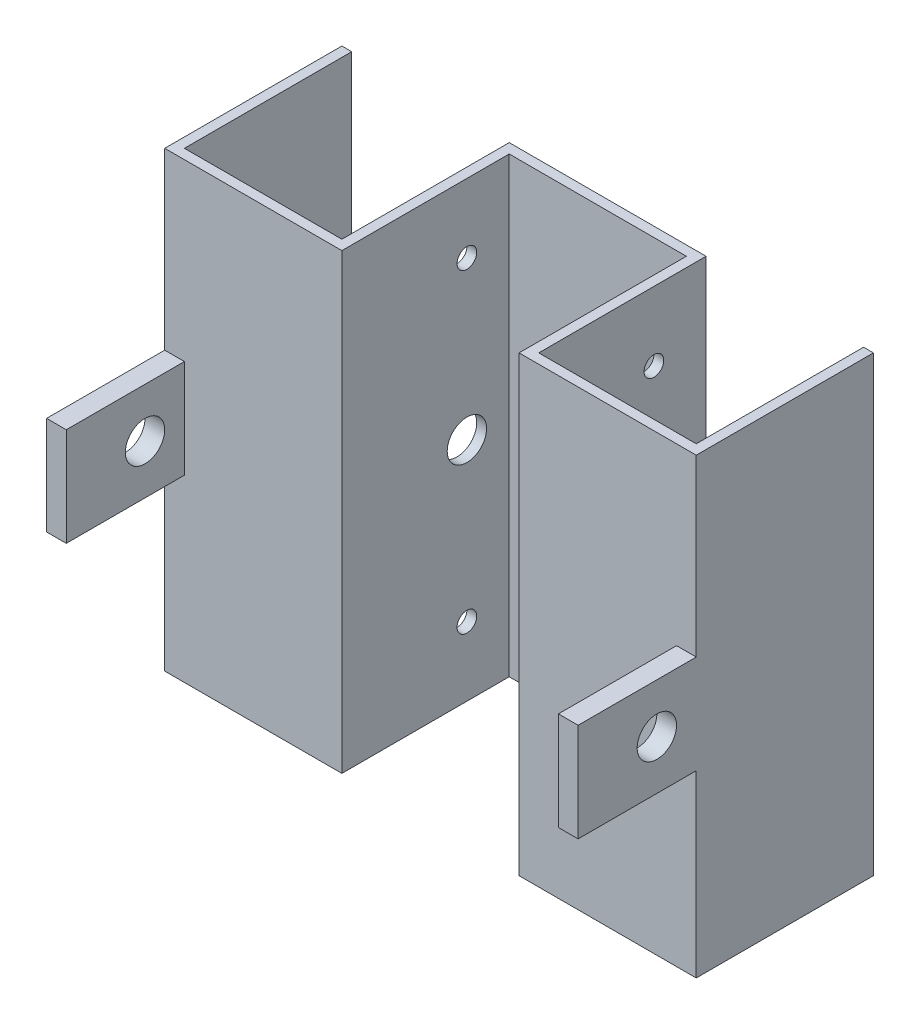
ISO-10303-21;
HEADER;
FILE_DESCRIPTION(('STEP AP214'),'2;1');
FILE_NAME('part.step','',(''),(''),'','','');
FILE_SCHEMA(('AUTOMOTIVE_DESIGN { 1 0 10303 214 1 1 1 1 }'));
ENDSEC;
DATA;
#1=APPLICATION_CONTEXT('core data for automotive mechanical design processes');
#2=APPLICATION_PROTOCOL_DEFINITION('international standard','automotive_design',2000,#1);
#3=PRODUCT_CONTEXT('',#1,'mechanical');
#4=PRODUCT('Part','Part','',(#3));
#5=PRODUCT_RELATED_PRODUCT_CATEGORY('part','',(#4));
#6=PRODUCT_DEFINITION_FORMATION('','',#4);
#7=PRODUCT_DEFINITION_CONTEXT('part definition',#1,'design');
#8=PRODUCT_DEFINITION('design','',#6,#7);
#9=PRODUCT_DEFINITION_SHAPE('','',#8);
#10=(LENGTH_UNIT() NAMED_UNIT(*) SI_UNIT(.MILLI.,.METRE.));
#11=(NAMED_UNIT(*) PLANE_ANGLE_UNIT() SI_UNIT($,.RADIAN.));
#12=(NAMED_UNIT(*) SI_UNIT($,.STERADIAN.) SOLID_ANGLE_UNIT());
#13=UNCERTAINTY_MEASURE_WITH_UNIT(LENGTH_MEASURE(1.E-05),#10,'distance_accuracy_value','');
#14=(GEOMETRIC_REPRESENTATION_CONTEXT(3) GLOBAL_UNCERTAINTY_ASSIGNED_CONTEXT((#13)) GLOBAL_UNIT_ASSIGNED_CONTEXT((#10,
#11,#12)) REPRESENTATION_CONTEXT('',''));
#15=CARTESIAN_POINT('',(0.,0.,0.));
#16=DIRECTION('',(0.,0.,1.));
#17=DIRECTION('',(1.,0.,0.));
#18=AXIS2_PLACEMENT_3D('',#15,#16,#17);
#19=CARTESIAN_POINT('',(0.,0.,90.));
#20=DIRECTION('',(0.,0.,-1.));
#21=DIRECTION('',(1.,0.,0.));
#22=AXIS2_PLACEMENT_3D('',#19,#20,#21);
#23=PLANE('',#22);
#24=DIRECTION('',(0.,1.,0.));
#25=VECTOR('',#24,1.);
#26=CARTESIAN_POINT('',(135.,250.,90.));
#27=LINE('',#26,#25);
#28=CARTESIAN_POINT('',(135.,151.191980235384,90.));
#29=VERTEX_POINT('',#28);
#30=CARTESIAN_POINT('',(135.,240.,90.));
#31=VERTEX_POINT('',#30);
#32=EDGE_CURVE('E435',#29,#31,#27,.T.);
#33=ORIENTED_EDGE('',*,*,#32,.T.);
#34=DIRECTION('',(1.,0.,0.));
#35=VECTOR('',#34,1.);
#36=CARTESIAN_POINT('',(-135.,240.,90.));
#37=LINE('',#36,#35);
#38=CARTESIAN_POINT('',(45.,240.,90.));
#39=VERTEX_POINT('',#38);
#40=EDGE_CURVE('E52',#39,#31,#37,.T.);
#41=ORIENTED_EDGE('',*,*,#40,.F.);
#42=DIRECTION('',(0.,1.,0.));
#43=VECTOR('',#42,1.);
#44=CARTESIAN_POINT('',(45.,250.,90.));
#45=LINE('',#44,#43);
#46=CARTESIAN_POINT('',(45.,9.99999999999999,90.));
#47=VERTEX_POINT('',#46);
#48=EDGE_CURVE('E247',#47,#39,#45,.T.);
#49=ORIENTED_EDGE('',*,*,#48,.F.);
#50=DIRECTION('',(1.,0.,0.));
#51=VECTOR('',#50,1.);
#52=CARTESIAN_POINT('',(-135.,10.,90.));
#53=LINE('',#52,#51);
#54=CARTESIAN_POINT('',(135.,9.99999999999998,90.));
#55=VERTEX_POINT('',#54);
#56=EDGE_CURVE('E323',#47,#55,#53,.T.);
#57=ORIENTED_EDGE('',*,*,#56,.T.);
#58=CARTESIAN_POINT('',(135.,101.191980235384,90.));
#59=VERTEX_POINT('',#58);
#60=EDGE_CURVE('E433',#55,#59,#27,.T.);
#61=ORIENTED_EDGE('',*,*,#60,.T.);
#62=DIRECTION('',(1.,0.,0.));
#63=VECTOR('',#62,1.);
#64=CARTESIAN_POINT('',(125.,101.191980235384,90.));
#65=LINE('',#64,#63);
#66=CARTESIAN_POINT('',(125.,101.191980235384,90.));
#67=VERTEX_POINT('',#66);
#68=EDGE_CURVE('E404',#67,#59,#65,.T.);
#69=ORIENTED_EDGE('',*,*,#68,.F.);
#70=DIRECTION('',(0.,-1.,0.));
#71=VECTOR('',#70,1.);
#72=CARTESIAN_POINT('',(125.,0.,90.));
#73=LINE('',#72,#71);
#74=CARTESIAN_POINT('',(125.,151.191980235384,90.));
#75=VERTEX_POINT('',#74);
#76=EDGE_CURVE('E380',#75,#67,#73,.T.);
#77=ORIENTED_EDGE('',*,*,#76,.F.);
#78=DIRECTION('',(1.,0.,0.));
#79=VECTOR('',#78,1.);
#80=CARTESIAN_POINT('',(125.,151.191980235384,90.));
#81=LINE('',#80,#79);
#82=EDGE_CURVE('E394',#75,#29,#81,.T.);
#83=ORIENTED_EDGE('',*,*,#82,.T.);
#84=EDGE_LOOP('',(#33,#41,#49,#57,#61,#69,#77,#83));
#85=FACE_BOUND('',#84,.T.);
#86=ADVANCED_FACE('F35',(#85),#23,.F.);
#87=CARTESIAN_POINT('',(50.,0.,5.));
#88=DIRECTION('',(1.,0.,0.));
#89=DIRECTION('',(0.,0.,-1.));
#90=AXIS2_PLACEMENT_3D('',#87,#88,#89);
#91=PLANE('',#90);
#92=DIRECTION('',(0.,0.,-1.));
#93=VECTOR('',#92,1.);
#94=CARTESIAN_POINT('',(50.,240.,5.));
#95=LINE('',#94,#93);
#96=CARTESIAN_POINT('',(50.,240.,85.));
#97=VERTEX_POINT('',#96);
#98=CARTESIAN_POINT('',(50.,240.,0.));
#99=VERTEX_POINT('',#98);
#100=EDGE_CURVE('E459',#97,#99,#95,.T.);
#101=ORIENTED_EDGE('',*,*,#100,.F.);
#102=DIRECTION('',(0.,-1.,0.));
#103=VECTOR('',#102,1.);
#104=CARTESIAN_POINT('',(50.,250.,85.));
#105=LINE('',#104,#103);
#106=CARTESIAN_POINT('',(50.,9.99999999999999,85.));
#107=VERTEX_POINT('',#106);
#108=EDGE_CURVE('E252',#97,#107,#105,.T.);
#109=ORIENTED_EDGE('',*,*,#108,.T.);
#110=DIRECTION('',(0.,0.,1.));
#111=VECTOR('',#110,1.);
#112=CARTESIAN_POINT('',(50.,10.,5.));
#113=LINE('',#112,#111);
#114=CARTESIAN_POINT('',(50.,10.,0.));
#115=VERTEX_POINT('',#114);
#116=EDGE_CURVE('E333',#115,#107,#113,.T.);
#117=ORIENTED_EDGE('',*,*,#116,.F.);
#118=DIRECTION('',(0.,-1.,0.));
#119=VECTOR('',#118,1.);
#120=CARTESIAN_POINT('',(50.,0.,0.));
#121=LINE('',#120,#119);
#122=EDGE_CURVE('E254',#99,#115,#121,.T.);
#123=ORIENTED_EDGE('',*,*,#122,.F.);
#124=EDGE_LOOP('',(#101,#109,#117,#123));
#125=FACE_BOUND('',#124,.T.);
#126=CARTESIAN_POINT('',(50.,205.,26.5));
#127=DIRECTION('',(-1.,0.,0.));
#128=DIRECTION('',(0.,0.,1.));
#129=AXIS2_PLACEMENT_3D('',#126,#127,#128);
#130=CIRCLE('',#129,5.);
#131=CARTESIAN_POINT('',(50.,205.,31.5));
#132=VERTEX_POINT('',#131);
#133=EDGE_CURVE('E418',#132,#132,#130,.T.);
#134=ORIENTED_EDGE('',*,*,#133,.T.);
#135=EDGE_LOOP('',(#134));
#136=FACE_BOUND('',#135,.T.);
#137=CARTESIAN_POINT('',(50.,125.,26.5));
#138=DIRECTION('',(-1.,0.,0.));
#139=DIRECTION('',(0.,0.,1.));
#140=AXIS2_PLACEMENT_3D('',#137,#138,#139);
#141=CIRCLE('',#140,10.);
#142=CARTESIAN_POINT('',(50.,125.,36.5));
#143=VERTEX_POINT('',#142);
#144=EDGE_CURVE('E424',#143,#143,#141,.T.);
#145=ORIENTED_EDGE('',*,*,#144,.T.);
#146=EDGE_LOOP('',(#145));
#147=FACE_BOUND('',#146,.T.);
#148=CARTESIAN_POINT('',(50.,45.,26.5));
#149=DIRECTION('',(-1.,0.,0.));
#150=DIRECTION('',(0.,0.,1.));
#151=AXIS2_PLACEMENT_3D('',#148,#149,#150);
#152=CIRCLE('',#151,5.);
#153=CARTESIAN_POINT('',(50.,45.,31.5));
#154=VERTEX_POINT('',#153);
#155=EDGE_CURVE('E407',#154,#154,#152,.T.);
#156=ORIENTED_EDGE('',*,*,#155,.T.);
#157=EDGE_LOOP('',(#156));
#158=FACE_BOUND('',#157,.T.);
#159=ADVANCED_FACE('F506',(#125,#136,#147,#158),#91,.T.);
#160=CARTESIAN_POINT('',(45.,250.,85.));
#161=DIRECTION('',(-1.,0.,0.));
#162=DIRECTION('',(0.,-1.,0.));
#163=AXIS2_PLACEMENT_3D('',#160,#161,#162);
#164=PLANE('',#163);
#165=DIRECTION('',(0.,0.,1.));
#166=VECTOR('',#165,1.);
#167=CARTESIAN_POINT('',(45.,240.,85.));
#168=LINE('',#167,#166);
#169=CARTESIAN_POINT('',(45.,240.,5.));
#170=VERTEX_POINT('',#169);
#171=EDGE_CURVE('E308',#170,#39,#168,.T.);
#172=ORIENTED_EDGE('',*,*,#171,.F.);
#173=DIRECTION('',(0.,1.,0.));
#174=VECTOR('',#173,1.);
#175=CARTESIAN_POINT('',(45.,250.,5.));
#176=LINE('',#175,#174);
#177=CARTESIAN_POINT('',(45.,10.,5.));
#178=VERTEX_POINT('',#177);
#179=EDGE_CURVE('E255',#178,#170,#176,.T.);
#180=ORIENTED_EDGE('',*,*,#179,.F.);
#181=DIRECTION('',(0.,0.,-1.));
#182=VECTOR('',#181,1.);
#183=CARTESIAN_POINT('',(45.,9.99999999999998,85.));
#184=LINE('',#183,#182);
#185=EDGE_CURVE('E344',#47,#178,#184,.T.);
#186=ORIENTED_EDGE('',*,*,#185,.F.);
#187=ORIENTED_EDGE('',*,*,#48,.T.);
#188=EDGE_LOOP('',(#172,#180,#186,#187));
#189=FACE_BOUND('',#188,.T.);
#190=CARTESIAN_POINT('',(45.,205.,26.5));
#191=DIRECTION('',(-1.,0.,0.));
#192=DIRECTION('',(0.,0.,1.));
#193=AXIS2_PLACEMENT_3D('',#190,#191,#192);
#194=CIRCLE('',#193,5.);
#195=CARTESIAN_POINT('',(45.,205.,31.5));
#196=VERTEX_POINT('',#195);
#197=EDGE_CURVE('E421',#196,#196,#194,.T.);
#198=ORIENTED_EDGE('',*,*,#197,.F.);
#199=EDGE_LOOP('',(#198));
#200=FACE_BOUND('',#199,.T.);
#201=CARTESIAN_POINT('',(45.,125.,26.5));
#202=DIRECTION('',(-1.,0.,0.));
#203=DIRECTION('',(0.,0.,1.));
#204=AXIS2_PLACEMENT_3D('',#201,#202,#203);
#205=CIRCLE('',#204,10.);
#206=CARTESIAN_POINT('',(45.,125.,36.5));
#207=VERTEX_POINT('',#206);
#208=EDGE_CURVE('E427',#207,#207,#205,.T.);
#209=ORIENTED_EDGE('',*,*,#208,.F.);
#210=EDGE_LOOP('',(#209));
#211=FACE_BOUND('',#210,.T.);
#212=CARTESIAN_POINT('',(45.,45.,26.5));
#213=DIRECTION('',(-1.,0.,0.));
#214=DIRECTION('',(0.,0.,1.));
#215=AXIS2_PLACEMENT_3D('',#212,#213,#214);
#216=CIRCLE('',#215,5.);
#217=CARTESIAN_POINT('',(45.,45.,31.5));
#218=VERTEX_POINT('',#217);
#219=EDGE_CURVE('E415',#218,#218,#216,.T.);
#220=ORIENTED_EDGE('',*,*,#219,.F.);
#221=EDGE_LOOP('',(#220));
#222=FACE_BOUND('',#221,.T.);
#223=ADVANCED_FACE('F281',(#189,#200,#211,#222),#164,.T.);
#224=CARTESIAN_POINT('',(-50.,0.,5.));
#225=DIRECTION('',(1.,0.,0.));
#226=DIRECTION('',(0.,0.,-1.));
#227=AXIS2_PLACEMENT_3D('',#224,#225,#226);
#228=PLANE('',#227);
#229=CARTESIAN_POINT('',(-50.,45.,26.5));
#230=DIRECTION('',(-1.,0.,0.));
#231=DIRECTION('',(0.,0.,1.));
#232=AXIS2_PLACEMENT_3D('',#229,#230,#231);
#233=CIRCLE('',#232,5.);
#234=CARTESIAN_POINT('',(-50.,45.,31.5));
#235=VERTEX_POINT('',#234);
#236=EDGE_CURVE('E260',#235,#235,#233,.T.);
#237=ORIENTED_EDGE('',*,*,#236,.F.);
#238=EDGE_LOOP('',(#237));
#239=FACE_BOUND('',#238,.T.);
#240=CARTESIAN_POINT('',(-50.,205.,26.5));
#241=DIRECTION('',(-1.,0.,0.));
#242=DIRECTION('',(0.,0.,1.));
#243=AXIS2_PLACEMENT_3D('',#240,#241,#242);
#244=CIRCLE('',#243,5.);
#245=CARTESIAN_POINT('',(-50.,205.,31.5));
#246=VERTEX_POINT('',#245);
#247=EDGE_CURVE('E263',#246,#246,#244,.T.);
#248=ORIENTED_EDGE('',*,*,#247,.F.);
#249=EDGE_LOOP('',(#248));
#250=FACE_BOUND('',#249,.T.);
#251=CARTESIAN_POINT('',(-50.,125.,26.5));
#252=DIRECTION('',(-1.,0.,0.));
#253=DIRECTION('',(0.,0.,1.));
#254=AXIS2_PLACEMENT_3D('',#251,#252,#253);
#255=CIRCLE('',#254,10.);
#256=CARTESIAN_POINT('',(-50.,125.,36.5));
#257=VERTEX_POINT('',#256);
#258=EDGE_CURVE('E234',#257,#257,#255,.T.);
#259=ORIENTED_EDGE('',*,*,#258,.F.);
#260=EDGE_LOOP('',(#259));
#261=FACE_BOUND('',#260,.T.);
#262=DIRECTION('',(0.,-1.,0.));
#263=VECTOR('',#262,1.);
#264=CARTESIAN_POINT('',(-50.,250.,85.));
#265=LINE('',#264,#263);
#266=CARTESIAN_POINT('',(-50.,240.,85.));
#267=VERTEX_POINT('',#266);
#268=CARTESIAN_POINT('',(-50.,10.,85.));
#269=VERTEX_POINT('',#268);
#270=EDGE_CURVE('E39',#267,#269,#265,.T.);
#271=ORIENTED_EDGE('',*,*,#270,.F.);
#272=DIRECTION('',(0.,0.,-1.));
#273=VECTOR('',#272,1.);
#274=CARTESIAN_POINT('',(-50.,240.,5.));
#275=LINE('',#274,#273);
#276=CARTESIAN_POINT('',(-50.,240.,0.));
#277=VERTEX_POINT('',#276);
#278=EDGE_CURVE('E286',#267,#277,#275,.T.);
#279=ORIENTED_EDGE('',*,*,#278,.T.);
#280=DIRECTION('',(0.,-1.,0.));
#281=VECTOR('',#280,1.);
#282=CARTESIAN_POINT('',(-50.,0.,0.));
#283=LINE('',#282,#281);
#284=CARTESIAN_POINT('',(-50.,10.,0.));
#285=VERTEX_POINT('',#284);
#286=EDGE_CURVE('E11',#277,#285,#283,.T.);
#287=ORIENTED_EDGE('',*,*,#286,.T.);
#288=DIRECTION('',(0.,0.,1.));
#289=VECTOR('',#288,1.);
#290=CARTESIAN_POINT('',(-50.,10.,5.));
#291=LINE('',#290,#289);
#292=EDGE_CURVE('E289',#285,#269,#291,.T.);
#293=ORIENTED_EDGE('',*,*,#292,.T.);
#294=EDGE_LOOP('',(#271,#279,#287,#293));
#295=FACE_BOUND('',#294,.T.);
#296=ADVANCED_FACE('F37',(#239,#250,#261,#295),#228,.F.);
#297=CARTESIAN_POINT('',(0.,0.,5.));
#298=DIRECTION('',(0.,0.,1.));
#299=DIRECTION('',(1.,0.,0.));
#300=AXIS2_PLACEMENT_3D('',#297,#298,#299);
#301=PLANE('',#300);
#302=DIRECTION('',(1.,0.,0.));
#303=VECTOR('',#302,1.);
#304=CARTESIAN_POINT('',(0.,240.,5.));
#305=LINE('',#304,#303);
#306=CARTESIAN_POINT('',(-45.,240.,5.));
#307=VERTEX_POINT('',#306);
#308=EDGE_CURVE('E306',#307,#170,#305,.T.);
#309=ORIENTED_EDGE('',*,*,#308,.F.);
#310=DIRECTION('',(0.,1.,0.));
#311=VECTOR('',#310,1.);
#312=CARTESIAN_POINT('',(-45.,250.,5.));
#313=LINE('',#312,#311);
#314=CARTESIAN_POINT('',(-45.,10.,5.));
#315=VERTEX_POINT('',#314);
#316=EDGE_CURVE('E239',#315,#307,#313,.T.);
#317=ORIENTED_EDGE('',*,*,#316,.F.);
#318=DIRECTION('',(-1.,0.,0.));
#319=VECTOR('',#318,1.);
#320=CARTESIAN_POINT('',(0.,10.,5.));
#321=LINE('',#320,#319);
#322=EDGE_CURVE('E304',#178,#315,#321,.T.);
#323=ORIENTED_EDGE('',*,*,#322,.F.);
#324=ORIENTED_EDGE('',*,*,#179,.T.);
#325=EDGE_LOOP('',(#309,#317,#323,#324));
#326=FACE_BOUND('',#325,.T.);
#327=ADVANCED_FACE('F280',(#326),#301,.T.);
#328=CARTESIAN_POINT('',(0.,0.,0.));
#329=DIRECTION('',(0.,0.,1.));
#330=DIRECTION('',(1.,0.,0.));
#331=AXIS2_PLACEMENT_3D('',#328,#329,#330);
#332=PLANE('',#331);
#333=ORIENTED_EDGE('',*,*,#286,.F.);
#334=DIRECTION('',(1.,0.,0.));
#335=VECTOR('',#334,1.);
#336=CARTESIAN_POINT('',(-135.,240.,0.));
#337=LINE('',#336,#335);
#338=EDGE_CURVE('E454',#277,#99,#337,.T.);
#339=ORIENTED_EDGE('',*,*,#338,.T.);
#340=ORIENTED_EDGE('',*,*,#122,.T.);
#341=DIRECTION('',(1.,0.,0.));
#342=VECTOR('',#341,1.);
#343=CARTESIAN_POINT('',(-135.,10.,0.));
#344=LINE('',#343,#342);
#345=EDGE_CURVE('E327',#285,#115,#344,.T.);
#346=ORIENTED_EDGE('',*,*,#345,.F.);
#347=EDGE_LOOP('',(#333,#339,#340,#346));
#348=FACE_BOUND('',#347,.T.);
#349=ADVANCED_FACE('F548',(#348),#332,.F.);
#350=CARTESIAN_POINT('',(-45.,250.,85.));
#351=DIRECTION('',(-1.,0.,0.));
#352=DIRECTION('',(0.,-1.,0.));
#353=AXIS2_PLACEMENT_3D('',#350,#351,#352);
#354=PLANE('',#353);
#355=CARTESIAN_POINT('',(-45.,45.,26.5));
#356=DIRECTION('',(-1.,0.,0.));
#357=DIRECTION('',(0.,0.,1.));
#358=AXIS2_PLACEMENT_3D('',#355,#356,#357);
#359=CIRCLE('',#358,5.);
#360=CARTESIAN_POINT('',(-45.,45.,31.5));
#361=VERTEX_POINT('',#360);
#362=EDGE_CURVE('E259',#361,#361,#359,.T.);
#363=ORIENTED_EDGE('',*,*,#362,.T.);
#364=EDGE_LOOP('',(#363));
#365=FACE_BOUND('',#364,.T.);
#366=CARTESIAN_POINT('',(-45.,205.,26.5));
#367=DIRECTION('',(-1.,0.,0.));
#368=DIRECTION('',(0.,0.,1.));
#369=AXIS2_PLACEMENT_3D('',#366,#367,#368);
#370=CIRCLE('',#369,5.);
#371=CARTESIAN_POINT('',(-45.,205.,31.5));
#372=VERTEX_POINT('',#371);
#373=EDGE_CURVE('E266',#372,#372,#370,.T.);
#374=ORIENTED_EDGE('',*,*,#373,.T.);
#375=EDGE_LOOP('',(#374));
#376=FACE_BOUND('',#375,.T.);
#377=CARTESIAN_POINT('',(-45.,125.,26.5));
#378=DIRECTION('',(-1.,0.,0.));
#379=DIRECTION('',(0.,0.,1.));
#380=AXIS2_PLACEMENT_3D('',#377,#378,#379);
#381=CIRCLE('',#380,10.);
#382=CARTESIAN_POINT('',(-45.,125.,36.5));
#383=VERTEX_POINT('',#382);
#384=EDGE_CURVE('E230',#383,#383,#381,.T.);
#385=ORIENTED_EDGE('',*,*,#384,.T.);
#386=EDGE_LOOP('',(#385));
#387=FACE_BOUND('',#386,.T.);
#388=ORIENTED_EDGE('',*,*,#316,.T.);
#389=DIRECTION('',(0.,0.,1.));
#390=VECTOR('',#389,1.);
#391=CARTESIAN_POINT('',(-45.,240.,85.));
#392=LINE('',#391,#390);
#393=CARTESIAN_POINT('',(-45.,240.,90.));
#394=VERTEX_POINT('',#393);
#395=EDGE_CURVE('E299',#307,#394,#392,.T.);
#396=ORIENTED_EDGE('',*,*,#395,.T.);
#397=DIRECTION('',(0.,1.,0.));
#398=VECTOR('',#397,1.);
#399=CARTESIAN_POINT('',(-45.,250.,90.));
#400=LINE('',#399,#398);
#401=CARTESIAN_POINT('',(-45.,10.,90.));
#402=VERTEX_POINT('',#401);
#403=EDGE_CURVE('E217',#402,#394,#400,.T.);
#404=ORIENTED_EDGE('',*,*,#403,.F.);
#405=DIRECTION('',(0.,0.,-1.));
#406=VECTOR('',#405,1.);
#407=CARTESIAN_POINT('',(-45.,10.,85.));
#408=LINE('',#407,#406);
#409=EDGE_CURVE('E300',#402,#315,#408,.T.);
#410=ORIENTED_EDGE('',*,*,#409,.T.);
#411=EDGE_LOOP('',(#388,#396,#404,#410));
#412=FACE_BOUND('',#411,.T.);
#413=ADVANCED_FACE('F298',(#365,#376,#387,#412),#354,.F.);
#414=CARTESIAN_POINT('',(0.,0.,90.));
#415=DIRECTION('',(0.,0.,-1.));
#416=DIRECTION('',(-1.,0.,0.));
#417=AXIS2_PLACEMENT_3D('',#414,#415,#416);
#418=PLANE('',#417);
#419=ORIENTED_EDGE('',*,*,#403,.T.);
#420=CARTESIAN_POINT('',(-135.,240.,90.));
#421=VERTEX_POINT('',#420);
#422=EDGE_CURVE('E200',#421,#394,#37,.T.);
#423=ORIENTED_EDGE('',*,*,#422,.F.);
#424=DIRECTION('',(0.,1.,0.));
#425=VECTOR('',#424,1.);
#426=CARTESIAN_POINT('',(-135.,250.,90.));
#427=LINE('',#426,#425);
#428=CARTESIAN_POINT('',(-135.,151.191980235384,90.));
#429=VERTEX_POINT('',#428);
#430=EDGE_CURVE('E214',#429,#421,#427,.T.);
#431=ORIENTED_EDGE('',*,*,#430,.F.);
#432=DIRECTION('',(-1.,0.,0.));
#433=VECTOR('',#432,1.);
#434=CARTESIAN_POINT('',(-125.,151.191980235384,90.));
#435=LINE('',#434,#433);
#436=CARTESIAN_POINT('',(-125.,151.191980235384,90.));
#437=VERTEX_POINT('',#436);
#438=EDGE_CURVE('E371',#437,#429,#435,.T.);
#439=ORIENTED_EDGE('',*,*,#438,.F.);
#440=DIRECTION('',(0.,-1.,0.));
#441=VECTOR('',#440,1.);
#442=CARTESIAN_POINT('',(-125.,151.191980235384,90.));
#443=LINE('',#442,#441);
#444=CARTESIAN_POINT('',(-125.,101.191980235384,90.));
#445=VERTEX_POINT('',#444);
#446=EDGE_CURVE('E353',#437,#445,#443,.T.);
#447=ORIENTED_EDGE('',*,*,#446,.T.);
#448=DIRECTION('',(-1.,0.,0.));
#449=VECTOR('',#448,1.);
#450=CARTESIAN_POINT('',(-125.,101.191980235384,90.));
#451=LINE('',#450,#449);
#452=CARTESIAN_POINT('',(-135.,101.191980235384,90.));
#453=VERTEX_POINT('',#452);
#454=EDGE_CURVE('E365',#445,#453,#451,.T.);
#455=ORIENTED_EDGE('',*,*,#454,.T.);
#456=CARTESIAN_POINT('',(-135.,10.,90.));
#457=VERTEX_POINT('',#456);
#458=EDGE_CURVE('E226',#457,#453,#427,.T.);
#459=ORIENTED_EDGE('',*,*,#458,.F.);
#460=EDGE_CURVE('E320',#457,#402,#53,.T.);
#461=ORIENTED_EDGE('',*,*,#460,.T.);
#462=EDGE_LOOP('',(#419,#423,#431,#439,#447,#455,#459,#461));
#463=FACE_BOUND('',#462,.T.);
#464=ADVANCED_FACE('F212',(#463),#418,.F.);
#465=CARTESIAN_POINT('',(0.,0.,85.));
#466=DIRECTION('',(0.,0.,-1.));
#467=DIRECTION('',(-1.,0.,0.));
#468=AXIS2_PLACEMENT_3D('',#465,#466,#467);
#469=PLANE('',#468);
#470=DIRECTION('',(-1.,0.,0.));
#471=VECTOR('',#470,1.);
#472=CARTESIAN_POINT('',(0.,240.,85.));
#473=LINE('',#472,#471);
#474=CARTESIAN_POINT('',(-130.,240.,85.));
#475=VERTEX_POINT('',#474);
#476=EDGE_CURVE('E463',#267,#475,#473,.T.);
#477=ORIENTED_EDGE('',*,*,#476,.F.);
#478=ORIENTED_EDGE('',*,*,#270,.T.);
#479=DIRECTION('',(1.,0.,0.));
#480=VECTOR('',#479,1.);
#481=CARTESIAN_POINT('',(0.,10.,85.));
#482=LINE('',#481,#480);
#483=CARTESIAN_POINT('',(-130.,10.,85.));
#484=VERTEX_POINT('',#483);
#485=EDGE_CURVE('E339',#484,#269,#482,.T.);
#486=ORIENTED_EDGE('',*,*,#485,.F.);
#487=DIRECTION('',(0.,-1.,0.));
#488=VECTOR('',#487,1.);
#489=CARTESIAN_POINT('',(-130.,250.,85.));
#490=LINE('',#489,#488);
#491=EDGE_CURVE('E236',#475,#484,#490,.T.);
#492=ORIENTED_EDGE('',*,*,#491,.F.);
#493=EDGE_LOOP('',(#477,#478,#486,#492));
#494=FACE_BOUND('',#493,.T.);
#495=ADVANCED_FACE('F470',(#494),#469,.T.);
#496=CARTESIAN_POINT('',(-135.,250.,0.));
#497=DIRECTION('',(0.,0.,1.));
#498=DIRECTION('',(1.,0.,0.));
#499=AXIS2_PLACEMENT_3D('',#496,#497,#498);
#500=PLANE('',#499);
#501=DIRECTION('',(0.,-1.,0.));
#502=VECTOR('',#501,1.);
#503=CARTESIAN_POINT('',(-135.,250.,0.));
#504=LINE('',#503,#502);
#505=CARTESIAN_POINT('',(-135.,240.,0.));
#506=VERTEX_POINT('',#505);
#507=CARTESIAN_POINT('',(-135.,10.,0.));
#508=VERTEX_POINT('',#507);
#509=EDGE_CURVE('E229',#506,#508,#504,.T.);
#510=ORIENTED_EDGE('',*,*,#509,.F.);
#511=CARTESIAN_POINT('',(-130.,240.,0.));
#512=VERTEX_POINT('',#511);
#513=EDGE_CURVE('E203',#506,#512,#337,.T.);
#514=ORIENTED_EDGE('',*,*,#513,.T.);
#515=DIRECTION('',(0.,-1.,0.));
#516=VECTOR('',#515,1.);
#517=CARTESIAN_POINT('',(-130.,250.,0.));
#518=LINE('',#517,#516);
#519=CARTESIAN_POINT('',(-130.,10.,0.));
#520=VERTEX_POINT('',#519);
#521=EDGE_CURVE('E227',#512,#520,#518,.T.);
#522=ORIENTED_EDGE('',*,*,#521,.T.);
#523=EDGE_CURVE('E324',#508,#520,#344,.T.);
#524=ORIENTED_EDGE('',*,*,#523,.F.);
#525=EDGE_LOOP('',(#510,#514,#522,#524));
#526=FACE_BOUND('',#525,.T.);
#527=ADVANCED_FACE('F478',(#526),#500,.F.);
#528=CARTESIAN_POINT('',(-135.,0.,0.));
#529=DIRECTION('',(1.,0.,0.));
#530=DIRECTION('',(0.,1.,0.));
#531=AXIS2_PLACEMENT_3D('',#528,#529,#530);
#532=PLANE('',#531);
#533=ORIENTED_EDGE('',*,*,#430,.T.);
#534=DIRECTION('',(0.,0.,-1.));
#535=VECTOR('',#534,1.);
#536=CARTESIAN_POINT('',(-135.,240.,90.));
#537=LINE('',#536,#535);
#538=EDGE_CURVE('E197',#421,#506,#537,.T.);
#539=ORIENTED_EDGE('',*,*,#538,.T.);
#540=ORIENTED_EDGE('',*,*,#509,.T.);
#541=DIRECTION('',(0.,0.,1.));
#542=VECTOR('',#541,1.);
#543=CARTESIAN_POINT('',(-135.,10.,90.));
#544=LINE('',#543,#542);
#545=EDGE_CURVE('E315',#508,#457,#544,.T.);
#546=ORIENTED_EDGE('',*,*,#545,.T.);
#547=ORIENTED_EDGE('',*,*,#458,.T.);
#548=DIRECTION('',(0.,0.,1.));
#549=VECTOR('',#548,1.);
#550=CARTESIAN_POINT('',(-135.,101.191980235384,90.));
#551=LINE('',#550,#549);
#552=CARTESIAN_POINT('',(-135.,101.191980235384,150.));
#553=VERTEX_POINT('',#552);
#554=EDGE_CURVE('E350',#453,#553,#551,.T.);
#555=ORIENTED_EDGE('',*,*,#554,.T.);
#556=DIRECTION('',(0.,1.,0.));
#557=VECTOR('',#556,1.);
#558=CARTESIAN_POINT('',(-135.,151.191980235384,150.));
#559=LINE('',#558,#557);
#560=CARTESIAN_POINT('',(-135.,151.191980235384,150.));
#561=VERTEX_POINT('',#560);
#562=EDGE_CURVE('E368',#553,#561,#559,.T.);
#563=ORIENTED_EDGE('',*,*,#562,.T.);
#564=DIRECTION('',(0.,0.,-1.));
#565=VECTOR('',#564,1.);
#566=CARTESIAN_POINT('',(-135.,151.191980235384,90.));
#567=LINE('',#566,#565);
#568=EDGE_CURVE('E224',#561,#429,#567,.T.);
#569=ORIENTED_EDGE('',*,*,#568,.T.);
#570=EDGE_LOOP('',(#533,#539,#540,#546,#547,#555,#563,#569));
#571=FACE_BOUND('',#570,.T.);
#572=CARTESIAN_POINT('',(-135.,126.191980235384,110.));
#573=DIRECTION('',(-1.,0.,0.));
#574=DIRECTION('',(0.,-1.,0.));
#575=AXIS2_PLACEMENT_3D('',#572,#573,#574);
#576=CIRCLE('',#575,10.);
#577=CARTESIAN_POINT('',(-135.,116.191980235384,110.));
#578=VERTEX_POINT('',#577);
#579=EDGE_CURVE('E346',#578,#578,#576,.T.);
#580=ORIENTED_EDGE('',*,*,#579,.F.);
#581=EDGE_LOOP('',(#580));
#582=FACE_BOUND('',#581,.T.);
#583=ADVANCED_FACE('F220',(#571,#582),#532,.F.);
#584=CARTESIAN_POINT('',(-130.,0.,0.));
#585=DIRECTION('',(1.,0.,0.));
#586=DIRECTION('',(0.,1.,0.));
#587=AXIS2_PLACEMENT_3D('',#584,#585,#586);
#588=PLANE('',#587);
#589=DIRECTION('',(0.,0.,-1.));
#590=VECTOR('',#589,1.);
#591=CARTESIAN_POINT('',(-130.,240.,0.));
#592=LINE('',#591,#590);
#593=EDGE_CURVE('E461',#475,#512,#592,.T.);
#594=ORIENTED_EDGE('',*,*,#593,.F.);
#595=ORIENTED_EDGE('',*,*,#491,.T.);
#596=DIRECTION('',(0.,0.,1.));
#597=VECTOR('',#596,1.);
#598=CARTESIAN_POINT('',(-130.,10.,0.));
#599=LINE('',#598,#597);
#600=EDGE_CURVE('E336',#520,#484,#599,.T.);
#601=ORIENTED_EDGE('',*,*,#600,.F.);
#602=ORIENTED_EDGE('',*,*,#521,.F.);
#603=EDGE_LOOP('',(#594,#595,#601,#602));
#604=FACE_BOUND('',#603,.T.);
#605=ADVANCED_FACE('F468',(#604),#588,.T.);
#606=CARTESIAN_POINT('',(-45.,125.,26.5));
#607=DIRECTION('',(-1.,0.,0.));
#608=DIRECTION('',(0.,0.,1.));
#609=AXIS2_PLACEMENT_3D('',#606,#607,#608);
#610=CYLINDRICAL_SURFACE('',#609,10.);
#611=ORIENTED_EDGE('',*,*,#384,.F.);
#612=EDGE_LOOP('',(#611));
#613=FACE_BOUND('',#612,.T.);
#614=ORIENTED_EDGE('',*,*,#258,.T.);
#615=EDGE_LOOP('',(#614));
#616=FACE_BOUND('',#615,.T.);
#617=ADVANCED_FACE('F276',(#613,#616),#610,.F.);
#618=CARTESIAN_POINT('',(-45.,205.,26.5));
#619=DIRECTION('',(-1.,0.,0.));
#620=DIRECTION('',(0.,0.,1.));
#621=AXIS2_PLACEMENT_3D('',#618,#619,#620);
#622=CYLINDRICAL_SURFACE('',#621,5.);
#623=ORIENTED_EDGE('',*,*,#373,.F.);
#624=EDGE_LOOP('',(#623));
#625=FACE_BOUND('',#624,.T.);
#626=ORIENTED_EDGE('',*,*,#247,.T.);
#627=EDGE_LOOP('',(#626));
#628=FACE_BOUND('',#627,.T.);
#629=ADVANCED_FACE('F528',(#625,#628),#622,.F.);
#630=CARTESIAN_POINT('',(-45.,45.,26.5));
#631=DIRECTION('',(-1.,0.,0.));
#632=DIRECTION('',(0.,0.,1.));
#633=AXIS2_PLACEMENT_3D('',#630,#631,#632);
#634=CYLINDRICAL_SURFACE('',#633,5.);
#635=ORIENTED_EDGE('',*,*,#362,.F.);
#636=EDGE_LOOP('',(#635));
#637=FACE_BOUND('',#636,.T.);
#638=ORIENTED_EDGE('',*,*,#236,.T.);
#639=EDGE_LOOP('',(#638));
#640=FACE_BOUND('',#639,.T.);
#641=ADVANCED_FACE('F521',(#637,#640),#634,.F.);
#642=CARTESIAN_POINT('',(0.,0.,85.));
#643=DIRECTION('',(0.,0.,-1.));
#644=DIRECTION('',(1.,0.,0.));
#645=AXIS2_PLACEMENT_3D('',#642,#643,#644);
#646=PLANE('',#645);
#647=DIRECTION('',(-1.,0.,0.));
#648=VECTOR('',#647,1.);
#649=CARTESIAN_POINT('',(0.,240.,85.));
#650=LINE('',#649,#648);
#651=CARTESIAN_POINT('',(130.,240.,85.));
#652=VERTEX_POINT('',#651);
#653=EDGE_CURVE('E457',#652,#97,#650,.T.);
#654=ORIENTED_EDGE('',*,*,#653,.F.);
#655=DIRECTION('',(0.,-1.,0.));
#656=VECTOR('',#655,1.);
#657=CARTESIAN_POINT('',(130.,250.,85.));
#658=LINE('',#657,#656);
#659=CARTESIAN_POINT('',(130.,9.99999999999998,85.));
#660=VERTEX_POINT('',#659);
#661=EDGE_CURVE('E244',#652,#660,#658,.T.);
#662=ORIENTED_EDGE('',*,*,#661,.T.);
#663=DIRECTION('',(1.,0.,0.));
#664=VECTOR('',#663,1.);
#665=CARTESIAN_POINT('',(0.,10.,85.));
#666=LINE('',#665,#664);
#667=EDGE_CURVE('E330',#107,#660,#666,.T.);
#668=ORIENTED_EDGE('',*,*,#667,.F.);
#669=ORIENTED_EDGE('',*,*,#108,.F.);
#670=EDGE_LOOP('',(#654,#662,#668,#669));
#671=FACE_BOUND('',#670,.T.);
#672=ADVANCED_FACE('F517',(#671),#646,.T.);
#673=CARTESIAN_POINT('',(130.,0.,0.));
#674=DIRECTION('',(-1.,0.,0.));
#675=DIRECTION('',(0.,1.,0.));
#676=AXIS2_PLACEMENT_3D('',#673,#674,#675);
#677=PLANE('',#676);
#678=DIRECTION('',(0.,0.,1.));
#679=VECTOR('',#678,1.);
#680=CARTESIAN_POINT('',(130.,240.,0.));
#681=LINE('',#680,#679);
#682=CARTESIAN_POINT('',(130.,240.,0.));
#683=VERTEX_POINT('',#682);
#684=EDGE_CURVE('E453',#683,#652,#681,.T.);
#685=ORIENTED_EDGE('',*,*,#684,.F.);
#686=DIRECTION('',(0.,-1.,0.));
#687=VECTOR('',#686,1.);
#688=CARTESIAN_POINT('',(130.,250.,0.));
#689=LINE('',#688,#687);
#690=CARTESIAN_POINT('',(130.,9.99999999999999,0.));
#691=VERTEX_POINT('',#690);
#692=EDGE_CURVE('E430',#683,#691,#689,.T.);
#693=ORIENTED_EDGE('',*,*,#692,.T.);
#694=DIRECTION('',(0.,0.,-1.));
#695=VECTOR('',#694,1.);
#696=CARTESIAN_POINT('',(130.,9.99999999999999,0.));
#697=LINE('',#696,#695);
#698=EDGE_CURVE('E322',#660,#691,#697,.T.);
#699=ORIENTED_EDGE('',*,*,#698,.F.);
#700=ORIENTED_EDGE('',*,*,#661,.F.);
#701=EDGE_LOOP('',(#685,#693,#699,#700));
#702=FACE_BOUND('',#701,.T.);
#703=ADVANCED_FACE('F520',(#702),#677,.T.);
#704=CARTESIAN_POINT('',(135.,250.,0.));
#705=DIRECTION('',(0.,0.,-1.));
#706=DIRECTION('',(-1.,0.,0.));
#707=AXIS2_PLACEMENT_3D('',#704,#705,#706);
#708=PLANE('',#707);
#709=CARTESIAN_POINT('',(135.,240.,0.));
#710=VERTEX_POINT('',#709);
#711=EDGE_CURVE('E218',#683,#710,#337,.T.);
#712=ORIENTED_EDGE('',*,*,#711,.T.);
#713=DIRECTION('',(0.,-1.,0.));
#714=VECTOR('',#713,1.);
#715=CARTESIAN_POINT('',(135.,250.,0.));
#716=LINE('',#715,#714);
#717=CARTESIAN_POINT('',(135.,10.,0.));
#718=VERTEX_POINT('',#717);
#719=EDGE_CURVE('E60',#710,#718,#716,.T.);
#720=ORIENTED_EDGE('',*,*,#719,.T.);
#721=EDGE_CURVE('E318',#691,#718,#344,.T.);
#722=ORIENTED_EDGE('',*,*,#721,.F.);
#723=ORIENTED_EDGE('',*,*,#692,.F.);
#724=EDGE_LOOP('',(#712,#720,#722,#723));
#725=FACE_BOUND('',#724,.T.);
#726=ADVANCED_FACE('F515',(#725),#708,.T.);
#727=CARTESIAN_POINT('',(135.,0.,0.));
#728=DIRECTION('',(-1.,0.,0.));
#729=DIRECTION('',(0.,1.,0.));
#730=AXIS2_PLACEMENT_3D('',#727,#728,#729);
#731=PLANE('',#730);
#732=ORIENTED_EDGE('',*,*,#719,.F.);
#733=DIRECTION('',(0.,0.,-1.));
#734=VECTOR('',#733,1.);
#735=CARTESIAN_POINT('',(135.,240.,90.));
#736=LINE('',#735,#734);
#737=EDGE_CURVE('E207',#31,#710,#736,.T.);
#738=ORIENTED_EDGE('',*,*,#737,.F.);
#739=ORIENTED_EDGE('',*,*,#32,.F.);
#740=DIRECTION('',(0.,0.,1.));
#741=VECTOR('',#740,1.);
#742=CARTESIAN_POINT('',(135.,151.191980235384,0.));
#743=LINE('',#742,#741);
#744=CARTESIAN_POINT('',(135.,151.191980235384,150.));
#745=VERTEX_POINT('',#744);
#746=EDGE_CURVE('E373',#29,#745,#743,.T.);
#747=ORIENTED_EDGE('',*,*,#746,.T.);
#748=DIRECTION('',(0.,1.,0.));
#749=VECTOR('',#748,1.);
#750=CARTESIAN_POINT('',(135.,0.,150.));
#751=LINE('',#750,#749);
#752=CARTESIAN_POINT('',(135.,101.191980235384,150.));
#753=VERTEX_POINT('',#752);
#754=EDGE_CURVE('E397',#753,#745,#751,.T.);
#755=ORIENTED_EDGE('',*,*,#754,.F.);
#756=DIRECTION('',(0.,0.,1.));
#757=VECTOR('',#756,1.);
#758=CARTESIAN_POINT('',(135.,101.191980235384,0.));
#759=LINE('',#758,#757);
#760=EDGE_CURVE('E400',#59,#753,#759,.T.);
#761=ORIENTED_EDGE('',*,*,#760,.F.);
#762=ORIENTED_EDGE('',*,*,#60,.F.);
#763=DIRECTION('',(0.,0.,1.));
#764=VECTOR('',#763,1.);
#765=CARTESIAN_POINT('',(135.,9.99999999999998,90.));
#766=LINE('',#765,#764);
#767=EDGE_CURVE('E310',#718,#55,#766,.T.);
#768=ORIENTED_EDGE('',*,*,#767,.F.);
#769=EDGE_LOOP('',(#732,#738,#739,#747,#755,#761,#762,#768));
#770=FACE_BOUND('',#769,.T.);
#771=CARTESIAN_POINT('',(135.,126.191980235384,110.));
#772=DIRECTION('',(1.,0.,0.));
#773=DIRECTION('',(0.,1.,0.));
#774=AXIS2_PLACEMENT_3D('',#771,#772,#773);
#775=CIRCLE('',#774,10.);
#776=CARTESIAN_POINT('',(135.,136.191980235384,110.));
#777=VERTEX_POINT('',#776);
#778=EDGE_CURVE('E384',#777,#777,#775,.T.);
#779=ORIENTED_EDGE('',*,*,#778,.F.);
#780=EDGE_LOOP('',(#779));
#781=FACE_BOUND('',#780,.T.);
#782=ADVANCED_FACE('F447',(#770,#781),#731,.F.);
#783=CARTESIAN_POINT('',(45.,125.,26.5));
#784=DIRECTION('',(1.,0.,0.));
#785=DIRECTION('',(0.,0.,-1.));
#786=AXIS2_PLACEMENT_3D('',#783,#784,#785);
#787=CYLINDRICAL_SURFACE('',#786,10.);
#788=ORIENTED_EDGE('',*,*,#208,.T.);
#789=EDGE_LOOP('',(#788));
#790=FACE_BOUND('',#789,.T.);
#791=ORIENTED_EDGE('',*,*,#144,.F.);
#792=EDGE_LOOP('',(#791));
#793=FACE_BOUND('',#792,.T.);
#794=ADVANCED_FACE('F585',(#790,#793),#787,.F.);
#795=CARTESIAN_POINT('',(45.,205.,26.5));
#796=DIRECTION('',(1.,0.,0.));
#797=DIRECTION('',(0.,0.,-1.));
#798=AXIS2_PLACEMENT_3D('',#795,#796,#797);
#799=CYLINDRICAL_SURFACE('',#798,5.);
#800=ORIENTED_EDGE('',*,*,#197,.T.);
#801=EDGE_LOOP('',(#800));
#802=FACE_BOUND('',#801,.T.);
#803=ORIENTED_EDGE('',*,*,#133,.F.);
#804=EDGE_LOOP('',(#803));
#805=FACE_BOUND('',#804,.T.);
#806=ADVANCED_FACE('F574',(#802,#805),#799,.F.);
#807=CARTESIAN_POINT('',(45.,45.,26.5));
#808=DIRECTION('',(1.,0.,0.));
#809=DIRECTION('',(0.,0.,-1.));
#810=AXIS2_PLACEMENT_3D('',#807,#808,#809);
#811=CYLINDRICAL_SURFACE('',#810,5.);
#812=ORIENTED_EDGE('',*,*,#219,.T.);
#813=EDGE_LOOP('',(#812));
#814=FACE_BOUND('',#813,.T.);
#815=ORIENTED_EDGE('',*,*,#155,.F.);
#816=EDGE_LOOP('',(#815));
#817=FACE_BOUND('',#816,.T.);
#818=ADVANCED_FACE('F570',(#814,#817),#811,.F.);
#819=CARTESIAN_POINT('',(125.,101.191980235384,0.));
#820=DIRECTION('',(0.,1.,0.));
#821=DIRECTION('',(0.,0.,1.));
#822=AXIS2_PLACEMENT_3D('',#819,#820,#821);
#823=PLANE('',#822);
#824=ORIENTED_EDGE('',*,*,#760,.T.);
#825=DIRECTION('',(1.,0.,0.));
#826=VECTOR('',#825,1.);
#827=CARTESIAN_POINT('',(125.,101.191980235384,150.));
#828=LINE('',#827,#826);
#829=CARTESIAN_POINT('',(125.,101.191980235384,150.));
#830=VERTEX_POINT('',#829);
#831=EDGE_CURVE('E408',#830,#753,#828,.T.);
#832=ORIENTED_EDGE('',*,*,#831,.F.);
#833=DIRECTION('',(0.,0.,1.));
#834=VECTOR('',#833,1.);
#835=CARTESIAN_POINT('',(125.,101.191980235384,0.));
#836=LINE('',#835,#834);
#837=EDGE_CURVE('E389',#67,#830,#836,.T.);
#838=ORIENTED_EDGE('',*,*,#837,.F.);
#839=ORIENTED_EDGE('',*,*,#68,.T.);
#840=EDGE_LOOP('',(#824,#832,#838,#839));
#841=FACE_BOUND('',#840,.T.);
#842=ADVANCED_FACE('F573',(#841),#823,.F.);
#843=CARTESIAN_POINT('',(125.,0.,150.));
#844=DIRECTION('',(0.,0.,-1.));
#845=DIRECTION('',(-1.,0.,0.));
#846=AXIS2_PLACEMENT_3D('',#843,#844,#845);
#847=PLANE('',#846);
#848=ORIENTED_EDGE('',*,*,#754,.T.);
#849=DIRECTION('',(1.,0.,0.));
#850=VECTOR('',#849,1.);
#851=CARTESIAN_POINT('',(125.,151.191980235384,150.));
#852=LINE('',#851,#850);
#853=CARTESIAN_POINT('',(125.,151.191980235384,150.));
#854=VERTEX_POINT('',#853);
#855=EDGE_CURVE('E411',#854,#745,#852,.T.);
#856=ORIENTED_EDGE('',*,*,#855,.F.);
#857=DIRECTION('',(0.,1.,0.));
#858=VECTOR('',#857,1.);
#859=CARTESIAN_POINT('',(125.,0.,150.));
#860=LINE('',#859,#858);
#861=EDGE_CURVE('E387',#830,#854,#860,.T.);
#862=ORIENTED_EDGE('',*,*,#861,.F.);
#863=ORIENTED_EDGE('',*,*,#831,.T.);
#864=EDGE_LOOP('',(#848,#856,#862,#863));
#865=FACE_BOUND('',#864,.T.);
#866=ADVANCED_FACE('F582',(#865),#847,.F.);
#867=CARTESIAN_POINT('',(125.,151.191980235384,0.));
#868=DIRECTION('',(0.,1.,0.));
#869=DIRECTION('',(-1.,0.,0.));
#870=AXIS2_PLACEMENT_3D('',#867,#868,#869);
#871=PLANE('',#870);
#872=ORIENTED_EDGE('',*,*,#746,.F.);
#873=ORIENTED_EDGE('',*,*,#82,.F.);
#874=DIRECTION('',(0.,0.,1.));
#875=VECTOR('',#874,1.);
#876=CARTESIAN_POINT('',(125.,151.191980235384,0.));
#877=LINE('',#876,#875);
#878=EDGE_CURVE('E383',#75,#854,#877,.T.);
#879=ORIENTED_EDGE('',*,*,#878,.T.);
#880=ORIENTED_EDGE('',*,*,#855,.T.);
#881=EDGE_LOOP('',(#872,#873,#879,#880));
#882=FACE_BOUND('',#881,.T.);
#883=ADVANCED_FACE('F589',(#882),#871,.T.);
#884=CARTESIAN_POINT('',(125.,126.191980235384,110.));
#885=DIRECTION('',(1.,0.,0.));
#886=DIRECTION('',(0.,1.,0.));
#887=AXIS2_PLACEMENT_3D('',#884,#885,#886);
#888=CYLINDRICAL_SURFACE('',#887,10.);
#889=CARTESIAN_POINT('',(125.,126.191980235384,110.));
#890=DIRECTION('',(1.,0.,0.));
#891=DIRECTION('',(0.,1.,0.));
#892=AXIS2_PLACEMENT_3D('',#889,#890,#891);
#893=CIRCLE('',#892,10.);
#894=CARTESIAN_POINT('',(125.,136.191980235384,110.));
#895=VERTEX_POINT('',#894);
#896=EDGE_CURVE('E391',#895,#895,#893,.T.);
#897=ORIENTED_EDGE('',*,*,#896,.F.);
#898=EDGE_LOOP('',(#897));
#899=FACE_BOUND('',#898,.T.);
#900=ORIENTED_EDGE('',*,*,#778,.T.);
#901=EDGE_LOOP('',(#900));
#902=FACE_BOUND('',#901,.T.);
#903=ADVANCED_FACE('F501',(#899,#902),#888,.F.);
#904=CARTESIAN_POINT('',(125.,0.,0.));
#905=DIRECTION('',(1.,0.,0.));
#906=DIRECTION('',(0.,1.,0.));
#907=AXIS2_PLACEMENT_3D('',#904,#905,#906);
#908=PLANE('',#907);
#909=ORIENTED_EDGE('',*,*,#76,.T.);
#910=ORIENTED_EDGE('',*,*,#837,.T.);
#911=ORIENTED_EDGE('',*,*,#861,.T.);
#912=ORIENTED_EDGE('',*,*,#878,.F.);
#913=EDGE_LOOP('',(#909,#910,#911,#912));
#914=FACE_BOUND('',#913,.T.);
#915=ORIENTED_EDGE('',*,*,#896,.T.);
#916=EDGE_LOOP('',(#915));
#917=FACE_BOUND('',#916,.T.);
#918=ADVANCED_FACE('F494',(#914,#917),#908,.F.);
#919=CARTESIAN_POINT('',(-125.,151.191980235384,90.));
#920=DIRECTION('',(0.,1.,0.));
#921=DIRECTION('',(-1.,0.,0.));
#922=AXIS2_PLACEMENT_3D('',#919,#920,#921);
#923=PLANE('',#922);
#924=ORIENTED_EDGE('',*,*,#568,.F.);
#925=DIRECTION('',(-1.,0.,0.));
#926=VECTOR('',#925,1.);
#927=CARTESIAN_POINT('',(-125.,151.191980235384,150.));
#928=LINE('',#927,#926);
#929=CARTESIAN_POINT('',(-125.,151.191980235384,150.));
#930=VERTEX_POINT('',#929);
#931=EDGE_CURVE('E374',#930,#561,#928,.T.);
#932=ORIENTED_EDGE('',*,*,#931,.F.);
#933=DIRECTION('',(0.,0.,-1.));
#934=VECTOR('',#933,1.);
#935=CARTESIAN_POINT('',(-125.,151.191980235384,90.));
#936=LINE('',#935,#934);
#937=EDGE_CURVE('E362',#930,#437,#936,.T.);
#938=ORIENTED_EDGE('',*,*,#937,.T.);
#939=ORIENTED_EDGE('',*,*,#438,.T.);
#940=EDGE_LOOP('',(#924,#932,#938,#939));
#941=FACE_BOUND('',#940,.T.);
#942=ADVANCED_FACE('F492',(#941),#923,.T.);
#943=CARTESIAN_POINT('',(-125.,151.191980235384,150.));
#944=DIRECTION('',(0.,0.,1.));
#945=DIRECTION('',(1.,0.,0.));
#946=AXIS2_PLACEMENT_3D('',#943,#944,#945);
#947=PLANE('',#946);
#948=ORIENTED_EDGE('',*,*,#562,.F.);
#949=DIRECTION('',(-1.,0.,0.));
#950=VECTOR('',#949,1.);
#951=CARTESIAN_POINT('',(-125.,101.191980235384,150.));
#952=LINE('',#951,#950);
#953=CARTESIAN_POINT('',(-125.,101.191980235384,150.));
#954=VERTEX_POINT('',#953);
#955=EDGE_CURVE('E376',#954,#553,#952,.T.);
#956=ORIENTED_EDGE('',*,*,#955,.F.);
#957=DIRECTION('',(0.,1.,0.));
#958=VECTOR('',#957,1.);
#959=CARTESIAN_POINT('',(-125.,151.191980235384,150.));
#960=LINE('',#959,#958);
#961=EDGE_CURVE('E359',#954,#930,#960,.T.);
#962=ORIENTED_EDGE('',*,*,#961,.T.);
#963=ORIENTED_EDGE('',*,*,#931,.T.);
#964=EDGE_LOOP('',(#948,#956,#962,#963));
#965=FACE_BOUND('',#964,.T.);
#966=ADVANCED_FACE('F490',(#965),#947,.T.);
#967=CARTESIAN_POINT('',(-125.,101.191980235384,90.));
#968=DIRECTION('',(0.,-1.,0.));
#969=DIRECTION('',(1.,0.,0.));
#970=AXIS2_PLACEMENT_3D('',#967,#968,#969);
#971=PLANE('',#970);
#972=ORIENTED_EDGE('',*,*,#554,.F.);
#973=ORIENTED_EDGE('',*,*,#454,.F.);
#974=DIRECTION('',(0.,0.,1.));
#975=VECTOR('',#974,1.);
#976=CARTESIAN_POINT('',(-125.,101.191980235384,90.));
#977=LINE('',#976,#975);
#978=EDGE_CURVE('E356',#445,#954,#977,.T.);
#979=ORIENTED_EDGE('',*,*,#978,.T.);
#980=ORIENTED_EDGE('',*,*,#955,.T.);
#981=EDGE_LOOP('',(#972,#973,#979,#980));
#982=FACE_BOUND('',#981,.T.);
#983=ADVANCED_FACE('F483',(#982),#971,.T.);
#984=CARTESIAN_POINT('',(-125.,0.,0.));
#985=DIRECTION('',(-1.,0.,0.));
#986=DIRECTION('',(0.,-1.,0.));
#987=AXIS2_PLACEMENT_3D('',#984,#985,#986);
#988=PLANE('',#987);
#989=CARTESIAN_POINT('',(-125.,126.191980235384,110.));
#990=DIRECTION('',(-1.,0.,0.));
#991=DIRECTION('',(0.,-1.,0.));
#992=AXIS2_PLACEMENT_3D('',#989,#990,#991);
#993=CIRCLE('',#992,10.);
#994=CARTESIAN_POINT('',(-125.,116.191980235384,110.));
#995=VERTEX_POINT('',#994);
#996=EDGE_CURVE('E347',#995,#995,#993,.T.);
#997=ORIENTED_EDGE('',*,*,#996,.T.);
#998=EDGE_LOOP('',(#997));
#999=FACE_BOUND('',#998,.T.);
#1000=ORIENTED_EDGE('',*,*,#446,.F.);
#1001=ORIENTED_EDGE('',*,*,#937,.F.);
#1002=ORIENTED_EDGE('',*,*,#961,.F.);
#1003=ORIENTED_EDGE('',*,*,#978,.F.);
#1004=EDGE_LOOP('',(#1000,#1001,#1002,#1003));
#1005=FACE_BOUND('',#1004,.T.);
#1006=ADVANCED_FACE('F486',(#999,#1005),#988,.F.);
#1007=CARTESIAN_POINT('',(-125.,126.191980235384,110.));
#1008=DIRECTION('',(-1.,0.,0.));
#1009=DIRECTION('',(0.,-1.,0.));
#1010=AXIS2_PLACEMENT_3D('',#1007,#1008,#1009);
#1011=CYLINDRICAL_SURFACE('',#1010,10.);
#1012=ORIENTED_EDGE('',*,*,#996,.F.);
#1013=EDGE_LOOP('',(#1012));
#1014=FACE_BOUND('',#1013,.T.);
#1015=ORIENTED_EDGE('',*,*,#579,.T.);
#1016=EDGE_LOOP('',(#1015));
#1017=FACE_BOUND('',#1016,.T.);
#1018=ADVANCED_FACE('F700',(#1014,#1017),#1011,.F.);
#1019=CARTESIAN_POINT('',(-135.,10.,90.));
#1020=DIRECTION('',(0.,1.,0.));
#1021=DIRECTION('',(-1.,0.,0.));
#1022=AXIS2_PLACEMENT_3D('',#1019,#1020,#1021);
#1023=PLANE('',#1022);
#1024=ORIENTED_EDGE('',*,*,#185,.T.);
#1025=ORIENTED_EDGE('',*,*,#322,.T.);
#1026=ORIENTED_EDGE('',*,*,#409,.F.);
#1027=ORIENTED_EDGE('',*,*,#460,.F.);
#1028=ORIENTED_EDGE('',*,*,#545,.F.);
#1029=ORIENTED_EDGE('',*,*,#523,.T.);
#1030=ORIENTED_EDGE('',*,*,#600,.T.);
#1031=ORIENTED_EDGE('',*,*,#485,.T.);
#1032=ORIENTED_EDGE('',*,*,#292,.F.);
#1033=ORIENTED_EDGE('',*,*,#345,.T.);
#1034=ORIENTED_EDGE('',*,*,#116,.T.);
#1035=ORIENTED_EDGE('',*,*,#667,.T.);
#1036=ORIENTED_EDGE('',*,*,#698,.T.);
#1037=ORIENTED_EDGE('',*,*,#721,.T.);
#1038=ORIENTED_EDGE('',*,*,#767,.T.);
#1039=ORIENTED_EDGE('',*,*,#56,.F.);
#1040=EDGE_LOOP('',(#1024,#1025,#1026,#1027,#1028,#1029,#1030,#1031,#1032,#1033,#1034,#1035,
#1036,#1037,#1038,#1039));
#1041=FACE_BOUND('',#1040,.T.);
#1042=ADVANCED_FACE('F472',(#1041),#1023,.F.);
#1043=CARTESIAN_POINT('',(-135.,240.,90.));
#1044=DIRECTION('',(0.,-1.,0.));
#1045=DIRECTION('',(1.,0.,0.));
#1046=AXIS2_PLACEMENT_3D('',#1043,#1044,#1045);
#1047=PLANE('',#1046);
#1048=ORIENTED_EDGE('',*,*,#171,.T.);
#1049=ORIENTED_EDGE('',*,*,#40,.T.);
#1050=ORIENTED_EDGE('',*,*,#737,.T.);
#1051=ORIENTED_EDGE('',*,*,#711,.F.);
#1052=ORIENTED_EDGE('',*,*,#684,.T.);
#1053=ORIENTED_EDGE('',*,*,#653,.T.);
#1054=ORIENTED_EDGE('',*,*,#100,.T.);
#1055=ORIENTED_EDGE('',*,*,#338,.F.);
#1056=ORIENTED_EDGE('',*,*,#278,.F.);
#1057=ORIENTED_EDGE('',*,*,#476,.T.);
#1058=ORIENTED_EDGE('',*,*,#593,.T.);
#1059=ORIENTED_EDGE('',*,*,#513,.F.);
#1060=ORIENTED_EDGE('',*,*,#538,.F.);
#1061=ORIENTED_EDGE('',*,*,#422,.T.);
#1062=ORIENTED_EDGE('',*,*,#395,.F.);
#1063=ORIENTED_EDGE('',*,*,#308,.T.);
#1064=EDGE_LOOP('',(#1048,#1049,#1050,#1051,#1052,#1053,#1054,#1055,#1056,#1057,#1058,#1059,
#1060,#1061,#1062,#1063));
#1065=FACE_BOUND('',#1064,.T.);
#1066=ADVANCED_FACE('F199',(#1065),#1047,.F.);
#1067=CLOSED_SHELL('',(#86,#159,#223,#296,#327,#349,#413,#464,#495,#527,#583,#605,#617,#629,
#641,#672,#703,#726,#782,#794,#806,#818,#842,#866,#883,#903,#918,#942,#966,#983,#1006,#1018,
#1042,#1066));
#1068=MANIFOLD_SOLID_BREP('B2',#1067);
#1069=ADVANCED_BREP_SHAPE_REPRESENTATION('',(#18,#1068),#14);
#1070=SHAPE_DEFINITION_REPRESENTATION(#9,#1069);
ENDSEC;
END-ISO-10303-21;
